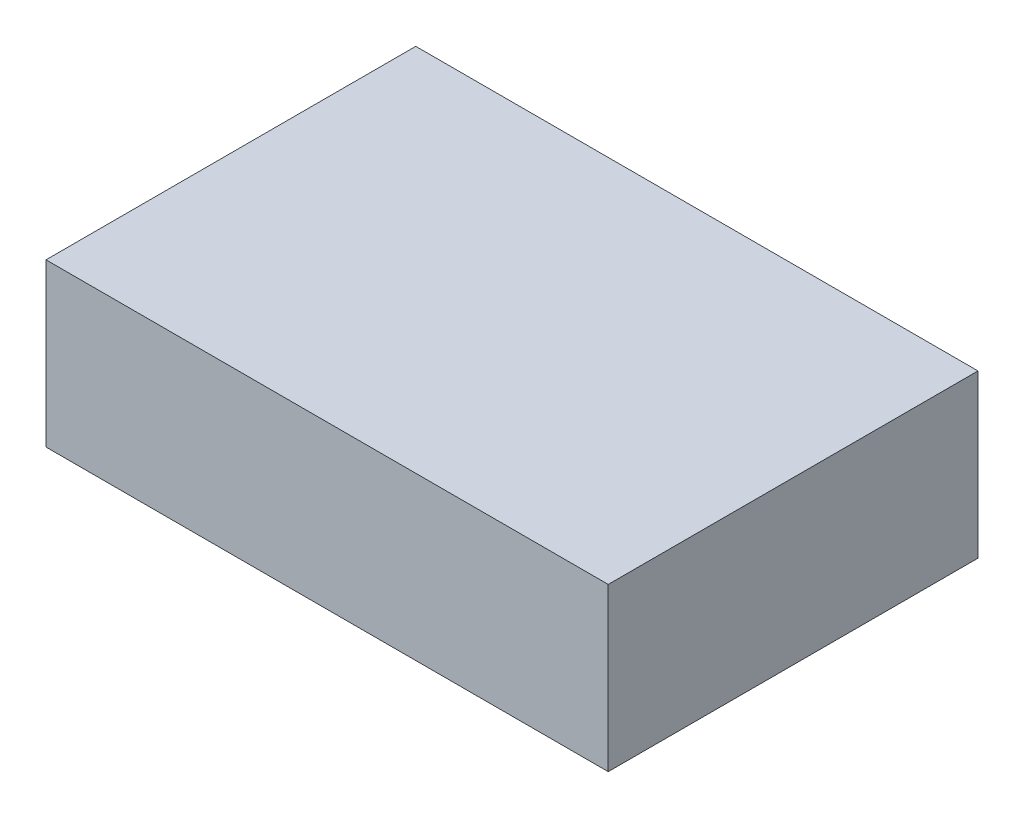
ISO-10303-21;
HEADER;
FILE_DESCRIPTION(('STEP AP214'),'2;1');
FILE_NAME('part.step','',(''),(''),'','','');
FILE_SCHEMA(('AUTOMOTIVE_DESIGN { 1 0 10303 214 1 1 1 1 }'));
ENDSEC;
DATA;
#1=APPLICATION_CONTEXT('core data for automotive mechanical design processes');
#2=APPLICATION_PROTOCOL_DEFINITION('international standard','automotive_design',2000,#1);
#3=PRODUCT_CONTEXT('',#1,'mechanical');
#4=PRODUCT('Part','Part','',(#3));
#5=PRODUCT_RELATED_PRODUCT_CATEGORY('part','',(#4));
#6=PRODUCT_DEFINITION_FORMATION('','',#4);
#7=PRODUCT_DEFINITION_CONTEXT('part definition',#1,'design');
#8=PRODUCT_DEFINITION('design','',#6,#7);
#9=PRODUCT_DEFINITION_SHAPE('','',#8);
#10=(LENGTH_UNIT() NAMED_UNIT(*) SI_UNIT(.MILLI.,.METRE.));
#11=(NAMED_UNIT(*) PLANE_ANGLE_UNIT() SI_UNIT($,.RADIAN.));
#12=(NAMED_UNIT(*) SI_UNIT($,.STERADIAN.) SOLID_ANGLE_UNIT());
#13=UNCERTAINTY_MEASURE_WITH_UNIT(LENGTH_MEASURE(1.E-05),#10,'distance_accuracy_value','');
#14=(GEOMETRIC_REPRESENTATION_CONTEXT(3) GLOBAL_UNCERTAINTY_ASSIGNED_CONTEXT((#13)) GLOBAL_UNIT_ASSIGNED_CONTEXT((#10,
#11,#12)) REPRESENTATION_CONTEXT('',''));
#15=CARTESIAN_POINT('',(0.,0.,0.));
#16=DIRECTION('',(0.,0.,1.));
#17=DIRECTION('',(1.,0.,0.));
#18=AXIS2_PLACEMENT_3D('',#15,#16,#17);
#19=CARTESIAN_POINT('',(-0.65000124,-0.18750026,0.));
#20=DIRECTION('',(0.,1.,0.));
#21=DIRECTION('',(0.,0.,1.));
#22=AXIS2_PLACEMENT_3D('',#19,#20,#21);
#23=PLANE('',#22);
#24=DIRECTION('',(0.,0.,1.));
#25=VECTOR('',#24,1.);
#26=CARTESIAN_POINT('',(0.65000124,-0.18750026,0.));
#27=LINE('',#26,#25);
#28=CARTESIAN_POINT('',(0.65000124,-0.18750026,0.));
#29=VERTEX_POINT('',#28);
#30=CARTESIAN_POINT('',(0.65000124,-0.18750026,0.85499956));
#31=VERTEX_POINT('',#30);
#32=EDGE_CURVE('E20',#29,#31,#27,.T.);
#33=ORIENTED_EDGE('',*,*,#32,.T.);
#34=DIRECTION('',(-1.,0.,0.));
#35=VECTOR('',#34,1.);
#36=CARTESIAN_POINT('',(0.65000124,-0.18750026,0.85499956));
#37=LINE('',#36,#35);
#38=CARTESIAN_POINT('',(-0.65000124,-0.18750026,0.85499956));
#39=VERTEX_POINT('',#38);
#40=EDGE_CURVE('E55',#31,#39,#37,.T.);
#41=ORIENTED_EDGE('',*,*,#40,.T.);
#42=DIRECTION('',(0.,0.,-1.));
#43=VECTOR('',#42,1.);
#44=CARTESIAN_POINT('',(-0.65000124,-0.18750026,0.));
#45=LINE('',#44,#43);
#46=CARTESIAN_POINT('',(-0.65000124,-0.18750026,0.));
#47=VERTEX_POINT('',#46);
#48=EDGE_CURVE('E76',#39,#47,#45,.T.);
#49=ORIENTED_EDGE('',*,*,#48,.T.);
#50=DIRECTION('',(-1.,0.,0.));
#51=VECTOR('',#50,1.);
#52=CARTESIAN_POINT('',(0.65000124,-0.18750026,0.));
#53=LINE('',#52,#51);
#54=EDGE_CURVE('E58',#29,#47,#53,.T.);
#55=ORIENTED_EDGE('',*,*,#54,.F.);
#56=EDGE_LOOP('',(#33,#41,#49,#55));
#57=FACE_BOUND('',#56,.T.);
#58=ADVANCED_FACE('F17',(#57),#23,.F.);
#59=CARTESIAN_POINT('',(0.65000124,-0.18750026,0.));
#60=DIRECTION('',(-1.,0.,0.));
#61=DIRECTION('',(0.,0.,1.));
#62=AXIS2_PLACEMENT_3D('',#59,#60,#61);
#63=PLANE('',#62);
#64=DIRECTION('',(0.,0.,-1.));
#65=VECTOR('',#64,1.);
#66=CARTESIAN_POINT('',(0.65000124,0.18750026,0.));
#67=LINE('',#66,#65);
#68=CARTESIAN_POINT('',(0.65000124,0.18750026,0.));
#69=VERTEX_POINT('',#68);
#70=CARTESIAN_POINT('',(0.65000124,0.18750026,0.85499956));
#71=VERTEX_POINT('',#70);
#72=EDGE_CURVE('E73',#69,#71,#67,.F.);
#73=ORIENTED_EDGE('',*,*,#72,.T.);
#74=DIRECTION('',(0.,1.,0.));
#75=VECTOR('',#74,1.);
#76=CARTESIAN_POINT('',(0.65000124,0.18750026,0.85499956));
#77=LINE('',#76,#75);
#78=EDGE_CURVE('E63',#71,#31,#77,.F.);
#79=ORIENTED_EDGE('',*,*,#78,.T.);
#80=ORIENTED_EDGE('',*,*,#32,.F.);
#81=DIRECTION('',(0.,1.,0.));
#82=VECTOR('',#81,1.);
#83=CARTESIAN_POINT('',(0.65000124,0.18750026,0.));
#84=LINE('',#83,#82);
#85=EDGE_CURVE('E78',#69,#29,#84,.F.);
#86=ORIENTED_EDGE('',*,*,#85,.F.);
#87=EDGE_LOOP('',(#73,#79,#80,#86));
#88=FACE_BOUND('',#87,.T.);
#89=ADVANCED_FACE('F72',(#88),#63,.F.);
#90=CARTESIAN_POINT('',(0.65000124,0.18750026,0.85499956));
#91=DIRECTION('',(0.,0.,-1.));
#92=DIRECTION('',(-1.,0.,0.));
#93=AXIS2_PLACEMENT_3D('',#90,#91,#92);
#94=PLANE('',#93);
#95=DIRECTION('',(0.,1.,0.));
#96=VECTOR('',#95,1.);
#97=CARTESIAN_POINT('',(-0.65000124,0.18750026,0.85499956));
#98=LINE('',#97,#96);
#99=CARTESIAN_POINT('',(-0.65000124,0.18750026,0.85499956));
#100=VERTEX_POINT('',#99);
#101=EDGE_CURVE('E69',#100,#39,#98,.F.);
#102=ORIENTED_EDGE('',*,*,#101,.T.);
#103=ORIENTED_EDGE('',*,*,#40,.F.);
#104=ORIENTED_EDGE('',*,*,#78,.F.);
#105=DIRECTION('',(1.,0.,0.));
#106=VECTOR('',#105,1.);
#107=CARTESIAN_POINT('',(0.65000124,0.18750026,0.85499956));
#108=LINE('',#107,#106);
#109=EDGE_CURVE('E83',#71,#100,#108,.F.);
#110=ORIENTED_EDGE('',*,*,#109,.T.);
#111=EDGE_LOOP('',(#102,#103,#104,#110));
#112=FACE_BOUND('',#111,.T.);
#113=ADVANCED_FACE('F66',(#112),#94,.F.);
#114=CARTESIAN_POINT('',(-0.65000124,0.18750026,0.));
#115=DIRECTION('',(1.,0.,0.));
#116=DIRECTION('',(0.,0.,-1.));
#117=AXIS2_PLACEMENT_3D('',#114,#115,#116);
#118=PLANE('',#117);
#119=ORIENTED_EDGE('',*,*,#48,.F.);
#120=ORIENTED_EDGE('',*,*,#101,.F.);
#121=DIRECTION('',(0.,0.,-1.));
#122=VECTOR('',#121,1.);
#123=CARTESIAN_POINT('',(-0.65000124,0.18750026,0.));
#124=LINE('',#123,#122);
#125=CARTESIAN_POINT('',(-0.65000124,0.18750026,0.));
#126=VERTEX_POINT('',#125);
#127=EDGE_CURVE('E26',#100,#126,#124,.T.);
#128=ORIENTED_EDGE('',*,*,#127,.T.);
#129=DIRECTION('',(0.,1.,0.));
#130=VECTOR('',#129,1.);
#131=CARTESIAN_POINT('',(-0.65000124,0.18750026,0.));
#132=LINE('',#131,#130);
#133=EDGE_CURVE('E34',#47,#126,#132,.T.);
#134=ORIENTED_EDGE('',*,*,#133,.F.);
#135=EDGE_LOOP('',(#119,#120,#128,#134));
#136=FACE_BOUND('',#135,.T.);
#137=ADVANCED_FACE('F88',(#136),#118,.F.);
#138=CARTESIAN_POINT('',(0.65000124,0.18750026,0.));
#139=DIRECTION('',(0.,0.,-1.));
#140=DIRECTION('',(-1.,0.,0.));
#141=AXIS2_PLACEMENT_3D('',#138,#139,#140);
#142=PLANE('',#141);
#143=ORIENTED_EDGE('',*,*,#133,.T.);
#144=DIRECTION('',(1.,0.,0.));
#145=VECTOR('',#144,1.);
#146=CARTESIAN_POINT('',(0.65000124,0.18750026,0.));
#147=LINE('',#146,#145);
#148=EDGE_CURVE('E11',#126,#69,#147,.T.);
#149=ORIENTED_EDGE('',*,*,#148,.T.);
#150=ORIENTED_EDGE('',*,*,#85,.T.);
#151=ORIENTED_EDGE('',*,*,#54,.T.);
#152=EDGE_LOOP('',(#143,#149,#150,#151));
#153=FACE_BOUND('',#152,.T.);
#154=ADVANCED_FACE('F91',(#153),#142,.T.);
#155=CARTESIAN_POINT('',(0.65000124,0.18750026,0.));
#156=DIRECTION('',(0.,-1.,0.));
#157=DIRECTION('',(0.,0.,-1.));
#158=AXIS2_PLACEMENT_3D('',#155,#156,#157);
#159=PLANE('',#158);
#160=ORIENTED_EDGE('',*,*,#127,.F.);
#161=ORIENTED_EDGE('',*,*,#109,.F.);
#162=ORIENTED_EDGE('',*,*,#72,.F.);
#163=ORIENTED_EDGE('',*,*,#148,.F.);
#164=EDGE_LOOP('',(#160,#161,#162,#163));
#165=FACE_BOUND('',#164,.T.);
#166=ADVANCED_FACE('F90',(#165),#159,.F.);
#167=CLOSED_SHELL('',(#58,#89,#113,#137,#154,#166));
#168=MANIFOLD_SOLID_BREP('B1',#167);
#169=ADVANCED_BREP_SHAPE_REPRESENTATION('',(#18,#168),#14);
#170=SHAPE_DEFINITION_REPRESENTATION(#9,#169);
ENDSEC;
END-ISO-10303-21;
